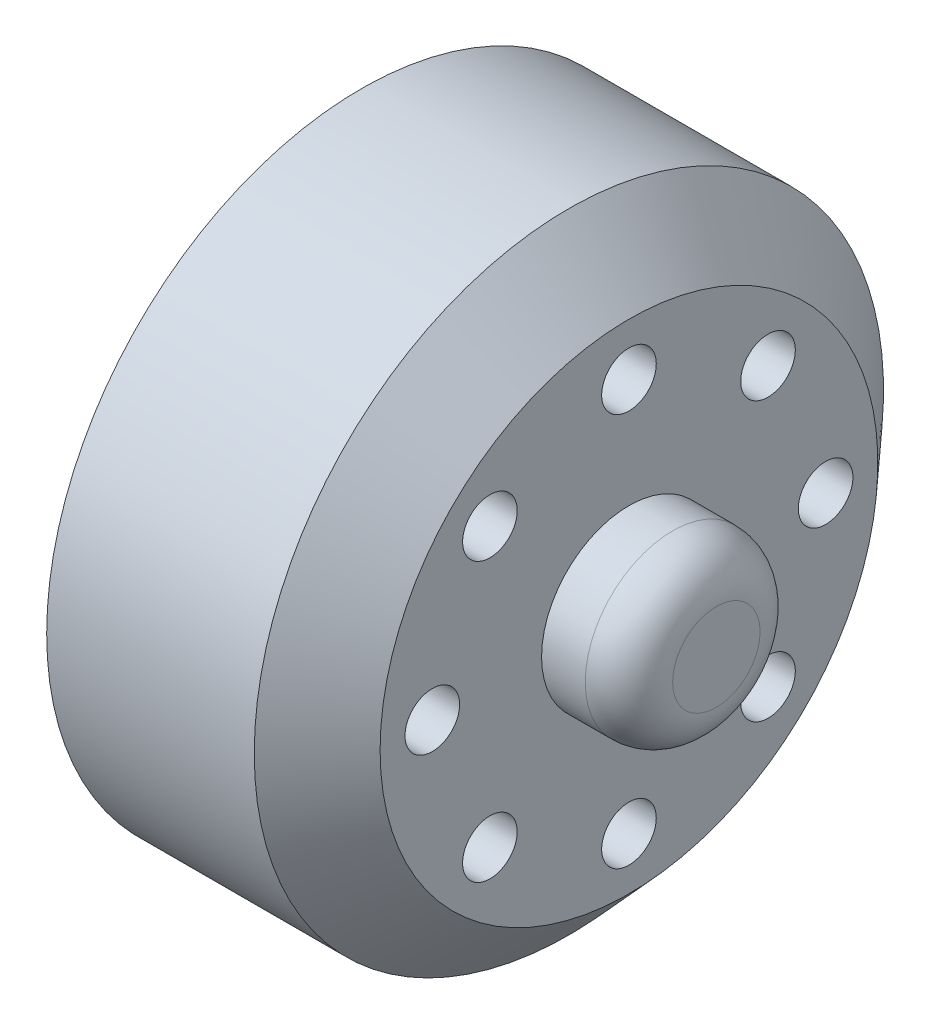
ISO-10303-21;
HEADER;
FILE_DESCRIPTION(('STEP AP214'),'2;1');
FILE_NAME('part.step','',(''),(''),'','','');
FILE_SCHEMA(('AUTOMOTIVE_DESIGN { 1 0 10303 214 1 1 1 1 }'));
ENDSEC;
DATA;
#1=APPLICATION_CONTEXT('core data for automotive mechanical design processes');
#2=APPLICATION_PROTOCOL_DEFINITION('international standard','automotive_design',2000,#1);
#3=PRODUCT_CONTEXT('',#1,'mechanical');
#4=PRODUCT('Part','Part','',(#3));
#5=PRODUCT_RELATED_PRODUCT_CATEGORY('part','',(#4));
#6=PRODUCT_DEFINITION_FORMATION('','',#4);
#7=PRODUCT_DEFINITION_CONTEXT('part definition',#1,'design');
#8=PRODUCT_DEFINITION('design','',#6,#7);
#9=PRODUCT_DEFINITION_SHAPE('','',#8);
#10=(LENGTH_UNIT() NAMED_UNIT(*) SI_UNIT(.MILLI.,.METRE.));
#11=(NAMED_UNIT(*) PLANE_ANGLE_UNIT() SI_UNIT($,.RADIAN.));
#12=(NAMED_UNIT(*) SI_UNIT($,.STERADIAN.) SOLID_ANGLE_UNIT());
#13=UNCERTAINTY_MEASURE_WITH_UNIT(LENGTH_MEASURE(1.E-05),#10,'distance_accuracy_value','');
#14=(GEOMETRIC_REPRESENTATION_CONTEXT(3) GLOBAL_UNCERTAINTY_ASSIGNED_CONTEXT((#13)) GLOBAL_UNIT_ASSIGNED_CONTEXT((#10,
#11,#12)) REPRESENTATION_CONTEXT('',''));
#15=CARTESIAN_POINT('',(0.,0.,0.));
#16=DIRECTION('',(0.,0.,1.));
#17=DIRECTION('',(1.,0.,0.));
#18=AXIS2_PLACEMENT_3D('',#15,#16,#17);
#19=CARTESIAN_POINT('',(-5.16596868854574,6.36396103067838,6.3639610306787));
#20=DIRECTION('',(1.,0.,0.));
#21=DIRECTION('',(0.,0.,-1.));
#22=AXIS2_PLACEMENT_3D('',#19,#20,#21);
#23=CYLINDRICAL_SURFACE('',#22,1.25000000000048);
#24=CARTESIAN_POINT('',(10.6195652173913,6.36396103067838,6.3639610306787));
#25=DIRECTION('',(1.,0.,0.));
#26=DIRECTION('',(0.,0.,-1.));
#27=AXIS2_PLACEMENT_3D('',#24,#25,#26);
#28=CIRCLE('',#27,1.25000000000048);
#29=CARTESIAN_POINT('',(10.6195652173913,6.36396103067838,5.11396103067823));
#30=VERTEX_POINT('',#29);
#31=EDGE_CURVE('E74',#30,#30,#28,.T.);
#32=ORIENTED_EDGE('',*,*,#31,.T.);
#33=EDGE_LOOP('',(#32));
#34=FACE_BOUND('',#33,.T.);
#35=CARTESIAN_POINT('',(5.61956521739131,6.36396103067838,6.3639610306787));
#36=DIRECTION('',(-1.,0.,0.));
#37=DIRECTION('',(0.,0.,1.));
#38=AXIS2_PLACEMENT_3D('',#35,#36,#37);
#39=CIRCLE('',#38,1.25000000000048);
#40=CARTESIAN_POINT('',(5.61956521739131,6.36396103067838,7.61396103067918));
#41=VERTEX_POINT('',#40);
#42=EDGE_CURVE('E38',#41,#41,#39,.F.);
#43=ORIENTED_EDGE('',*,*,#42,.F.);
#44=EDGE_LOOP('',(#43));
#45=FACE_BOUND('',#44,.T.);
#46=ADVANCED_FACE('F34',(#34,#45),#23,.F.);
#47=CARTESIAN_POINT('',(-5.16596868854574,-7.66835063561292E-13,8.99999999999923));
#48=DIRECTION('',(1.,0.,0.));
#49=DIRECTION('',(0.,0.,-1.));
#50=AXIS2_PLACEMENT_3D('',#47,#48,#49);
#51=CYLINDRICAL_SURFACE('',#50,1.25000000000105);
#52=CARTESIAN_POINT('',(10.6195652173913,-7.66835063561292E-13,8.99999999999923));
#53=DIRECTION('',(1.,0.,0.));
#54=DIRECTION('',(0.,0.,-1.));
#55=AXIS2_PLACEMENT_3D('',#52,#53,#54);
#56=CIRCLE('',#55,1.25000000000105);
#57=CARTESIAN_POINT('',(10.6195652173913,-7.66835063561292E-13,7.74999999999819));
#58=VERTEX_POINT('',#57);
#59=EDGE_CURVE('E78',#58,#58,#56,.T.);
#60=ORIENTED_EDGE('',*,*,#59,.T.);
#61=EDGE_LOOP('',(#60));
#62=FACE_BOUND('',#61,.T.);
#63=CARTESIAN_POINT('',(5.61956521739131,-7.66835063561292E-13,8.99999999999923));
#64=DIRECTION('',(-1.,0.,0.));
#65=DIRECTION('',(0.,0.,1.));
#66=AXIS2_PLACEMENT_3D('',#63,#64,#65);
#67=CIRCLE('',#66,1.25000000000105);
#68=CARTESIAN_POINT('',(5.61956521739131,-7.66835063561292E-13,10.2500000000003));
#69=VERTEX_POINT('',#68);
#70=EDGE_CURVE('E69',#69,#69,#67,.F.);
#71=ORIENTED_EDGE('',*,*,#70,.F.);
#72=EDGE_LOOP('',(#71));
#73=FACE_BOUND('',#72,.T.);
#74=ADVANCED_FACE('F137',(#62,#73),#51,.F.);
#75=CARTESIAN_POINT('',(-5.16596868854574,-6.36396103067947,6.36396103067762));
#76=DIRECTION('',(1.,0.,0.));
#77=DIRECTION('',(0.,0.,-1.));
#78=AXIS2_PLACEMENT_3D('',#75,#76,#77);
#79=CYLINDRICAL_SURFACE('',#78,1.25000000000148);
#80=CARTESIAN_POINT('',(10.6195652173913,-6.36396103067947,6.36396103067762));
#81=DIRECTION('',(1.,0.,0.));
#82=DIRECTION('',(0.,0.,-1.));
#83=AXIS2_PLACEMENT_3D('',#80,#81,#82);
#84=CIRCLE('',#83,1.25000000000148);
#85=CARTESIAN_POINT('',(10.6195652173913,-6.36396103067947,5.11396103067614));
#86=VERTEX_POINT('',#85);
#87=EDGE_CURVE('E83',#86,#86,#84,.T.);
#88=ORIENTED_EDGE('',*,*,#87,.T.);
#89=EDGE_LOOP('',(#88));
#90=FACE_BOUND('',#89,.T.);
#91=CARTESIAN_POINT('',(5.61956521739131,-6.36396103067947,6.36396103067762));
#92=DIRECTION('',(-1.,0.,0.));
#93=DIRECTION('',(0.,0.,1.));
#94=AXIS2_PLACEMENT_3D('',#91,#92,#93);
#95=CIRCLE('',#94,1.25000000000148);
#96=CARTESIAN_POINT('',(5.61956521739131,-6.36396103067947,7.6139610306791));
#97=VERTEX_POINT('',#96);
#98=EDGE_CURVE('E67',#97,#97,#95,.F.);
#99=ORIENTED_EDGE('',*,*,#98,.F.);
#100=EDGE_LOOP('',(#99));
#101=FACE_BOUND('',#100,.T.);
#102=ADVANCED_FACE('F142',(#90,#101),#79,.F.);
#103=CARTESIAN_POINT('',(-5.16596868854574,-9.,-1.53146576288412E-12));
#104=DIRECTION('',(1.,0.,0.));
#105=DIRECTION('',(0.,0.,-1.));
#106=AXIS2_PLACEMENT_3D('',#103,#104,#105);
#107=CYLINDRICAL_SURFACE('',#106,1.25000000000152);
#108=CARTESIAN_POINT('',(10.6195652173913,-9.,-1.53146576288412E-12));
#109=DIRECTION('',(1.,0.,0.));
#110=DIRECTION('',(0.,0.,-1.));
#111=AXIS2_PLACEMENT_3D('',#108,#109,#110);
#112=CIRCLE('',#111,1.25000000000152);
#113=CARTESIAN_POINT('',(10.6195652173913,-9.,-1.25000000000306));
#114=VERTEX_POINT('',#113);
#115=EDGE_CURVE('E222',#114,#114,#112,.T.);
#116=ORIENTED_EDGE('',*,*,#115,.T.);
#117=EDGE_LOOP('',(#116));
#118=FACE_BOUND('',#117,.T.);
#119=CARTESIAN_POINT('',(5.61956521739131,-9.,-1.53146576288412E-12));
#120=DIRECTION('',(-1.,0.,0.));
#121=DIRECTION('',(0.,0.,1.));
#122=AXIS2_PLACEMENT_3D('',#119,#120,#121);
#123=CIRCLE('',#122,1.25000000000152);
#124=CARTESIAN_POINT('',(5.61956521739131,-9.,1.24999999999999));
#125=VERTEX_POINT('',#124);
#126=EDGE_CURVE('E64',#125,#125,#123,.F.);
#127=ORIENTED_EDGE('',*,*,#126,.F.);
#128=EDGE_LOOP('',(#127));
#129=FACE_BOUND('',#128,.T.);
#130=ADVANCED_FACE('F234',(#118,#129),#107,.F.);
#131=CARTESIAN_POINT('',(-5.16596868854574,-6.36396103067839,-6.36396103068023));
#132=DIRECTION('',(1.,0.,0.));
#133=DIRECTION('',(0.,0.,-1.));
#134=AXIS2_PLACEMENT_3D('',#131,#132,#133);
#135=CYLINDRICAL_SURFACE('',#134,1.25000000000114);
#136=CARTESIAN_POINT('',(10.6195652173913,-6.36396103067839,-6.36396103068023));
#137=DIRECTION('',(1.,0.,0.));
#138=DIRECTION('',(0.,0.,-1.));
#139=AXIS2_PLACEMENT_3D('',#136,#137,#138);
#140=CIRCLE('',#139,1.25000000000114);
#141=CARTESIAN_POINT('',(10.6195652173913,-6.36396103067839,-7.61396103068137));
#142=VERTEX_POINT('',#141);
#143=EDGE_CURVE('E219',#142,#142,#140,.T.);
#144=ORIENTED_EDGE('',*,*,#143,.T.);
#145=EDGE_LOOP('',(#144));
#146=FACE_BOUND('',#145,.T.);
#147=CARTESIAN_POINT('',(5.61956521739131,-6.36396103067839,-6.36396103068023));
#148=DIRECTION('',(-1.,0.,0.));
#149=DIRECTION('',(0.,0.,1.));
#150=AXIS2_PLACEMENT_3D('',#147,#148,#149);
#151=CIRCLE('',#150,1.25000000000114);
#152=CARTESIAN_POINT('',(5.61956521739131,-6.36396103067839,-5.1139610306791));
#153=VERTEX_POINT('',#152);
#154=EDGE_CURVE('E61',#153,#153,#151,.F.);
#155=ORIENTED_EDGE('',*,*,#154,.F.);
#156=EDGE_LOOP('',(#155));
#157=FACE_BOUND('',#156,.T.);
#158=ADVANCED_FACE('F299',(#146,#157),#135,.F.);
#159=CARTESIAN_POINT('',(-5.16596868854574,7.65732881442059E-13,-9.00000000000076));
#160=DIRECTION('',(1.,0.,0.));
#161=DIRECTION('',(0.,0.,-1.));
#162=AXIS2_PLACEMENT_3D('',#159,#160,#161);
#163=CYLINDRICAL_SURFACE('',#162,1.25000000000054);
#164=CARTESIAN_POINT('',(10.6195652173913,7.65732881442059E-13,-9.00000000000076));
#165=DIRECTION('',(1.,0.,0.));
#166=DIRECTION('',(0.,0.,-1.));
#167=AXIS2_PLACEMENT_3D('',#164,#165,#166);
#168=CIRCLE('',#167,1.25000000000054);
#169=CARTESIAN_POINT('',(10.6195652173913,7.65732881442059E-13,-10.2500000000013));
#170=VERTEX_POINT('',#169);
#171=EDGE_CURVE('E216',#170,#170,#168,.T.);
#172=ORIENTED_EDGE('',*,*,#171,.T.);
#173=EDGE_LOOP('',(#172));
#174=FACE_BOUND('',#173,.T.);
#175=CARTESIAN_POINT('',(5.61956521739131,7.65732881442059E-13,-9.00000000000076));
#176=DIRECTION('',(-1.,0.,0.));
#177=DIRECTION('',(0.,0.,1.));
#178=AXIS2_PLACEMENT_3D('',#175,#176,#177);
#179=CIRCLE('',#178,1.25000000000054);
#180=CARTESIAN_POINT('',(5.61956521739131,7.65732881442059E-13,-7.75000000000023));
#181=VERTEX_POINT('',#180);
#182=EDGE_CURVE('E58',#181,#181,#179,.F.);
#183=ORIENTED_EDGE('',*,*,#182,.F.);
#184=EDGE_LOOP('',(#183));
#185=FACE_BOUND('',#184,.T.);
#186=ADVANCED_FACE('F295',(#174,#185),#163,.F.);
#187=CARTESIAN_POINT('',(-5.16596868854574,6.36396103067947,-6.36396103067915));
#188=DIRECTION('',(1.,0.,0.));
#189=DIRECTION('',(0.,0.,-1.));
#190=AXIS2_PLACEMENT_3D('',#187,#188,#189);
#191=CYLINDRICAL_SURFACE('',#190,1.25000000000007);
#192=CARTESIAN_POINT('',(10.6195652173913,6.36396103067947,-6.36396103067915));
#193=DIRECTION('',(1.,0.,0.));
#194=DIRECTION('',(0.,0.,-1.));
#195=AXIS2_PLACEMENT_3D('',#192,#193,#194);
#196=CIRCLE('',#195,1.25000000000007);
#197=CARTESIAN_POINT('',(10.6195652173913,6.36396103067947,-7.61396103067922));
#198=VERTEX_POINT('',#197);
#199=EDGE_CURVE('E213',#198,#198,#196,.T.);
#200=ORIENTED_EDGE('',*,*,#199,.T.);
#201=EDGE_LOOP('',(#200));
#202=FACE_BOUND('',#201,.T.);
#203=CARTESIAN_POINT('',(5.61956521739131,6.36396103067947,-6.36396103067915));
#204=DIRECTION('',(-1.,0.,0.));
#205=DIRECTION('',(0.,0.,1.));
#206=AXIS2_PLACEMENT_3D('',#203,#204,#205);
#207=CIRCLE('',#206,1.25000000000007);
#208=CARTESIAN_POINT('',(5.61956521739131,6.36396103067947,-5.11396103067908));
#209=VERTEX_POINT('',#208);
#210=EDGE_CURVE('E54',#209,#209,#207,.F.);
#211=ORIENTED_EDGE('',*,*,#210,.F.);
#212=EDGE_LOOP('',(#211));
#213=FACE_BOUND('',#212,.T.);
#214=ADVANCED_FACE('F166',(#202,#213),#191,.F.);
#215=CARTESIAN_POINT('',(-5.16596868854574,9.,0.));
#216=DIRECTION('',(1.,0.,0.));
#217=DIRECTION('',(0.,0.,-1.));
#218=AXIS2_PLACEMENT_3D('',#215,#216,#217);
#219=CYLINDRICAL_SURFACE('',#218,1.25);
#220=CARTESIAN_POINT('',(10.6195652173913,9.,0.));
#221=DIRECTION('',(1.,0.,0.));
#222=DIRECTION('',(0.,0.,-1.));
#223=AXIS2_PLACEMENT_3D('',#220,#221,#222);
#224=CIRCLE('',#223,1.25);
#225=CARTESIAN_POINT('',(10.6195652173913,9.,-1.25));
#226=VERTEX_POINT('',#225);
#227=EDGE_CURVE('E91',#226,#226,#224,.T.);
#228=ORIENTED_EDGE('',*,*,#227,.T.);
#229=EDGE_LOOP('',(#228));
#230=FACE_BOUND('',#229,.T.);
#231=CARTESIAN_POINT('',(5.61956521739131,9.,0.));
#232=DIRECTION('',(-1.,0.,0.));
#233=DIRECTION('',(0.,0.,1.));
#234=AXIS2_PLACEMENT_3D('',#231,#232,#233);
#235=CIRCLE('',#234,1.25);
#236=CARTESIAN_POINT('',(5.61956521739131,9.,1.25));
#237=VERTEX_POINT('',#236);
#238=EDGE_CURVE('E51',#237,#237,#235,.F.);
#239=ORIENTED_EDGE('',*,*,#238,.F.);
#240=EDGE_LOOP('',(#239));
#241=FACE_BOUND('',#240,.T.);
#242=ADVANCED_FACE('F161',(#230,#241),#219,.F.);
#243=CARTESIAN_POINT('',(-1.63043478260869,0.,-14.4));
#244=DIRECTION('',(1.,0.,0.));
#245=DIRECTION('',(0.,0.,-1.));
#246=AXIS2_PLACEMENT_3D('',#243,#244,#245);
#247=PLANE('',#246);
#248=CARTESIAN_POINT('',(-1.63043478260869,6.36396103067838,-6.3639610306787));
#249=DIRECTION('',(-1.,0.,0.));
#250=DIRECTION('',(0.,0.,1.));
#251=AXIS2_PLACEMENT_3D('',#248,#249,#250);
#252=CIRCLE('',#251,2.50000000000048);
#253=CARTESIAN_POINT('',(-1.63043478260869,6.36396103067838,-3.86396103067823));
#254=VERTEX_POINT('',#253);
#255=EDGE_CURVE('E172',#254,#254,#252,.T.);
#256=ORIENTED_EDGE('',*,*,#255,.F.);
#257=EDGE_LOOP('',(#256));
#258=FACE_BOUND('',#257,.T.);
#259=CARTESIAN_POINT('',(-1.63043478260869,-7.66835063561292E-13,-8.99999999999923));
#260=DIRECTION('',(-1.,0.,0.));
#261=DIRECTION('',(0.,0.,1.));
#262=AXIS2_PLACEMENT_3D('',#259,#260,#261);
#263=CIRCLE('',#262,2.50000000000105);
#264=CARTESIAN_POINT('',(-1.63043478260869,-7.66835063561292E-13,-6.49999999999819));
#265=VERTEX_POINT('',#264);
#266=EDGE_CURVE('E176',#265,#265,#263,.T.);
#267=ORIENTED_EDGE('',*,*,#266,.F.);
#268=EDGE_LOOP('',(#267));
#269=FACE_BOUND('',#268,.T.);
#270=CARTESIAN_POINT('',(-1.63043478260869,-6.36396103067947,-6.36396103067762));
#271=DIRECTION('',(-1.,0.,0.));
#272=DIRECTION('',(0.,0.,1.));
#273=AXIS2_PLACEMENT_3D('',#270,#271,#272);
#274=CIRCLE('',#273,2.50000000000148);
#275=CARTESIAN_POINT('',(-1.63043478260869,-6.36396103067947,-3.86396103067614));
#276=VERTEX_POINT('',#275);
#277=EDGE_CURVE('E180',#276,#276,#274,.T.);
#278=ORIENTED_EDGE('',*,*,#277,.F.);
#279=EDGE_LOOP('',(#278));
#280=FACE_BOUND('',#279,.T.);
#281=CARTESIAN_POINT('',(-1.63043478260869,-9.,1.53146576288412E-12));
#282=DIRECTION('',(-1.,0.,0.));
#283=DIRECTION('',(0.,0.,1.));
#284=AXIS2_PLACEMENT_3D('',#281,#282,#283);
#285=CIRCLE('',#284,2.50000000000153);
#286=CARTESIAN_POINT('',(-1.63043478260869,-9.,2.50000000000306));
#287=VERTEX_POINT('',#286);
#288=EDGE_CURVE('E184',#287,#287,#285,.T.);
#289=ORIENTED_EDGE('',*,*,#288,.F.);
#290=EDGE_LOOP('',(#289));
#291=FACE_BOUND('',#290,.T.);
#292=CARTESIAN_POINT('',(-1.63043478260869,-6.36396103067839,6.36396103068023));
#293=DIRECTION('',(-1.,0.,0.));
#294=DIRECTION('',(0.,0.,1.));
#295=AXIS2_PLACEMENT_3D('',#292,#293,#294);
#296=CIRCLE('',#295,2.50000000000114);
#297=CARTESIAN_POINT('',(-1.63043478260869,-6.36396103067839,8.86396103068137));
#298=VERTEX_POINT('',#297);
#299=EDGE_CURVE('E188',#298,#298,#296,.T.);
#300=ORIENTED_EDGE('',*,*,#299,.F.);
#301=EDGE_LOOP('',(#300));
#302=FACE_BOUND('',#301,.T.);
#303=CARTESIAN_POINT('',(-1.63043478260869,7.65732881442059E-13,9.00000000000076));
#304=DIRECTION('',(-1.,0.,0.));
#305=DIRECTION('',(0.,0.,1.));
#306=AXIS2_PLACEMENT_3D('',#303,#304,#305);
#307=CIRCLE('',#306,2.50000000000054);
#308=CARTESIAN_POINT('',(-1.63043478260869,7.65732881442059E-13,11.5000000000013));
#309=VERTEX_POINT('',#308);
#310=EDGE_CURVE('E192',#309,#309,#307,.T.);
#311=ORIENTED_EDGE('',*,*,#310,.F.);
#312=EDGE_LOOP('',(#311));
#313=FACE_BOUND('',#312,.T.);
#314=CARTESIAN_POINT('',(-1.63043478260869,6.36396103067947,6.36396103067915));
#315=DIRECTION('',(-1.,0.,0.));
#316=DIRECTION('',(0.,0.,1.));
#317=AXIS2_PLACEMENT_3D('',#314,#315,#316);
#318=CIRCLE('',#317,2.50000000000007);
#319=CARTESIAN_POINT('',(-1.63043478260869,6.36396103067947,8.86396103067922));
#320=VERTEX_POINT('',#319);
#321=EDGE_CURVE('E196',#320,#320,#318,.T.);
#322=ORIENTED_EDGE('',*,*,#321,.F.);
#323=EDGE_LOOP('',(#322));
#324=FACE_BOUND('',#323,.T.);
#325=CARTESIAN_POINT('',(-1.63043478260869,9.,0.));
#326=DIRECTION('',(-1.,0.,0.));
#327=DIRECTION('',(0.,0.,1.));
#328=AXIS2_PLACEMENT_3D('',#325,#326,#327);
#329=CIRCLE('',#328,2.5);
#330=CARTESIAN_POINT('',(-1.63043478260869,9.,2.5));
#331=VERTEX_POINT('',#330);
#332=EDGE_CURVE('E199',#331,#331,#329,.T.);
#333=ORIENTED_EDGE('',*,*,#332,.F.);
#334=EDGE_LOOP('',(#333));
#335=FACE_BOUND('',#334,.T.);
#336=CARTESIAN_POINT('',(-1.63043478260869,0.,0.));
#337=DIRECTION('',(-1.,0.,0.));
#338=DIRECTION('',(0.,0.,1.));
#339=AXIS2_PLACEMENT_3D('',#336,#337,#338);
#340=CIRCLE('',#339,5.7);
#341=CARTESIAN_POINT('',(-1.63043478260869,0.,5.7));
#342=VERTEX_POINT('',#341);
#343=EDGE_CURVE('E87',#342,#342,#340,.T.);
#344=ORIENTED_EDGE('',*,*,#343,.F.);
#345=EDGE_LOOP('',(#344));
#346=FACE_BOUND('',#345,.T.);
#347=CARTESIAN_POINT('',(-1.63043478260869,0.,0.));
#348=DIRECTION('',(-1.,0.,0.));
#349=DIRECTION('',(0.,0.,1.));
#350=AXIS2_PLACEMENT_3D('',#347,#348,#349);
#351=CIRCLE('',#350,14.4);
#352=CARTESIAN_POINT('',(-1.63043478260869,0.,14.4));
#353=VERTEX_POINT('',#352);
#354=EDGE_CURVE('E47',#353,#353,#351,.T.);
#355=ORIENTED_EDGE('',*,*,#354,.T.);
#356=EDGE_LOOP('',(#355));
#357=FACE_BOUND('',#356,.T.);
#358=ADVANCED_FACE('F105',(#258,#269,#280,#291,#302,#313,#324,#335,#346,#357),#247,.F.);
#359=CARTESIAN_POINT('',(-12.3913043478261,0.,0.));
#360=DIRECTION('',(-1.,0.,0.));
#361=DIRECTION('',(0.,0.,1.));
#362=AXIS2_PLACEMENT_3D('',#359,#360,#361);
#363=CYLINDRICAL_SURFACE('',#362,14.4);
#364=ORIENTED_EDGE('',*,*,#354,.F.);
#365=EDGE_LOOP('',(#364));
#366=FACE_BOUND('',#365,.T.);
#367=CARTESIAN_POINT('',(7.8695652173913,0.,0.));
#368=DIRECTION('',(-1.,0.,0.));
#369=DIRECTION('',(0.,0.,1.));
#370=AXIS2_PLACEMENT_3D('',#367,#368,#369);
#371=CIRCLE('',#370,14.4);
#372=CARTESIAN_POINT('',(7.8695652173913,0.,14.4));
#373=VERTEX_POINT('',#372);
#374=EDGE_CURVE('E100',#373,#373,#371,.T.);
#375=ORIENTED_EDGE('',*,*,#374,.T.);
#376=EDGE_LOOP('',(#375));
#377=FACE_BOUND('',#376,.T.);
#378=ADVANCED_FACE('F107',(#366,#377),#363,.T.);
#379=CARTESIAN_POINT('',(10.6195652173913,0.,0.));
#380=DIRECTION('',(-1.,0.,0.));
#381=DIRECTION('',(0.,0.,1.));
#382=AXIS2_PLACEMENT_3D('',#379,#380,#381);
#383=CONICAL_SURFACE('',#382,11.3904761178154,0.830427658098904);
#384=ORIENTED_EDGE('',*,*,#374,.F.);
#385=EDGE_LOOP('',(#384));
#386=FACE_BOUND('',#385,.T.);
#387=CARTESIAN_POINT('',(10.6195652173913,0.,0.));
#388=DIRECTION('',(-1.,0.,0.));
#389=DIRECTION('',(0.,0.,1.));
#390=AXIS2_PLACEMENT_3D('',#387,#388,#389);
#391=CIRCLE('',#390,11.3904761178154);
#392=CARTESIAN_POINT('',(10.6195652173913,0.,11.3904761178154));
#393=VERTEX_POINT('',#392);
#394=EDGE_CURVE('E97',#393,#393,#391,.T.);
#395=ORIENTED_EDGE('',*,*,#394,.T.);
#396=EDGE_LOOP('',(#395));
#397=FACE_BOUND('',#396,.T.);
#398=ADVANCED_FACE('F110',(#386,#397),#383,.T.);
#399=CARTESIAN_POINT('',(10.6195652173913,0.,-11.3904761178154));
#400=DIRECTION('',(-1.,0.,0.));
#401=DIRECTION('',(0.,0.,1.));
#402=AXIS2_PLACEMENT_3D('',#399,#400,#401);
#403=PLANE('',#402);
#404=ORIENTED_EDGE('',*,*,#227,.F.);
#405=EDGE_LOOP('',(#404));
#406=FACE_BOUND('',#405,.T.);
#407=ORIENTED_EDGE('',*,*,#199,.F.);
#408=EDGE_LOOP('',(#407));
#409=FACE_BOUND('',#408,.T.);
#410=ORIENTED_EDGE('',*,*,#171,.F.);
#411=EDGE_LOOP('',(#410));
#412=FACE_BOUND('',#411,.T.);
#413=ORIENTED_EDGE('',*,*,#143,.F.);
#414=EDGE_LOOP('',(#413));
#415=FACE_BOUND('',#414,.T.);
#416=ORIENTED_EDGE('',*,*,#115,.F.);
#417=EDGE_LOOP('',(#416));
#418=FACE_BOUND('',#417,.T.);
#419=ORIENTED_EDGE('',*,*,#87,.F.);
#420=EDGE_LOOP('',(#419));
#421=FACE_BOUND('',#420,.T.);
#422=ORIENTED_EDGE('',*,*,#59,.F.);
#423=EDGE_LOOP('',(#422));
#424=FACE_BOUND('',#423,.T.);
#425=ORIENTED_EDGE('',*,*,#31,.F.);
#426=EDGE_LOOP('',(#425));
#427=FACE_BOUND('',#426,.T.);
#428=ORIENTED_EDGE('',*,*,#394,.F.);
#429=EDGE_LOOP('',(#428));
#430=FACE_BOUND('',#429,.T.);
#431=CARTESIAN_POINT('',(10.6195652173913,0.,0.));
#432=DIRECTION('',(-1.,0.,0.));
#433=DIRECTION('',(0.,0.,1.));
#434=AXIS2_PLACEMENT_3D('',#431,#432,#433);
#435=CIRCLE('',#434,4.);
#436=CARTESIAN_POINT('',(10.6195652173913,0.,4.));
#437=VERTEX_POINT('',#436);
#438=EDGE_CURVE('E94',#437,#437,#435,.T.);
#439=ORIENTED_EDGE('',*,*,#438,.T.);
#440=EDGE_LOOP('',(#439));
#441=FACE_BOUND('',#440,.T.);
#442=ADVANCED_FACE('F116',(#406,#409,#412,#415,#418,#421,#424,#427,#430,#441),#403,.F.);
#443=CARTESIAN_POINT('',(-12.3913043478261,0.,0.));
#444=DIRECTION('',(-1.,0.,0.));
#445=DIRECTION('',(0.,0.,1.));
#446=AXIS2_PLACEMENT_3D('',#443,#444,#445);
#447=CYLINDRICAL_SURFACE('',#446,4.);
#448=CARTESIAN_POINT('',(12.6195652173913,0.,0.));
#449=DIRECTION('',(-1.,0.,0.));
#450=DIRECTION('',(0.,0.,1.));
#451=AXIS2_PLACEMENT_3D('',#448,#449,#450);
#452=CIRCLE('',#451,4.);
#453=CARTESIAN_POINT('',(12.6195652173913,0.,4.));
#454=VERTEX_POINT('',#453);
#455=EDGE_CURVE('E42',#454,#454,#452,.T.);
#456=ORIENTED_EDGE('',*,*,#455,.T.);
#457=EDGE_LOOP('',(#456));
#458=FACE_BOUND('',#457,.T.);
#459=ORIENTED_EDGE('',*,*,#438,.F.);
#460=EDGE_LOOP('',(#459));
#461=FACE_BOUND('',#460,.T.);
#462=ADVANCED_FACE('F122',(#458,#461),#447,.T.);
#463=CARTESIAN_POINT('',(14.6195652173913,0.,-4.));
#464=DIRECTION('',(-1.,0.,0.));
#465=DIRECTION('',(0.,0.,1.));
#466=AXIS2_PLACEMENT_3D('',#463,#464,#465);
#467=PLANE('',#466);
#468=CARTESIAN_POINT('',(14.6195652173913,0.,0.));
#469=DIRECTION('',(-1.,0.,0.));
#470=DIRECTION('',(0.,0.,1.));
#471=AXIS2_PLACEMENT_3D('',#468,#469,#470);
#472=CIRCLE('',#471,2.);
#473=CARTESIAN_POINT('',(14.6195652173913,0.,2.));
#474=VERTEX_POINT('',#473);
#475=EDGE_CURVE('E11',#474,#474,#472,.F.);
#476=ORIENTED_EDGE('',*,*,#475,.T.);
#477=EDGE_LOOP('',(#476));
#478=FACE_BOUND('',#477,.T.);
#479=ADVANCED_FACE('F128',(#478),#467,.F.);
#480=CARTESIAN_POINT('',(3.07169239559481,0.,-5.7));
#481=DIRECTION('',(1.,0.,0.));
#482=DIRECTION('',(0.,0.,-1.));
#483=AXIS2_PLACEMENT_3D('',#480,#481,#482);
#484=PLANE('',#483);
#485=CARTESIAN_POINT('',(3.07169239559481,0.,0.));
#486=DIRECTION('',(-1.,0.,0.));
#487=DIRECTION('',(0.,0.,1.));
#488=AXIS2_PLACEMENT_3D('',#485,#486,#487);
#489=CIRCLE('',#488,5.7);
#490=CARTESIAN_POINT('',(3.07169239559481,0.,5.7));
#491=VERTEX_POINT('',#490);
#492=EDGE_CURVE('E90',#491,#491,#489,.T.);
#493=ORIENTED_EDGE('',*,*,#492,.T.);
#494=EDGE_LOOP('',(#493));
#495=FACE_BOUND('',#494,.T.);
#496=ADVANCED_FACE('F134',(#495),#484,.F.);
#497=CARTESIAN_POINT('',(-12.3913043478261,0.,0.));
#498=DIRECTION('',(-1.,0.,0.));
#499=DIRECTION('',(0.,0.,1.));
#500=AXIS2_PLACEMENT_3D('',#497,#498,#499);
#501=CYLINDRICAL_SURFACE('',#500,5.7);
#502=ORIENTED_EDGE('',*,*,#492,.F.);
#503=EDGE_LOOP('',(#502));
#504=FACE_BOUND('',#503,.T.);
#505=ORIENTED_EDGE('',*,*,#343,.T.);
#506=EDGE_LOOP('',(#505));
#507=FACE_BOUND('',#506,.T.);
#508=ADVANCED_FACE('F148',(#504,#507),#501,.F.);
#509=CARTESIAN_POINT('',(12.6195652173913,0.,0.));
#510=DIRECTION('',(-1.,0.,0.));
#511=DIRECTION('',(0.,0.,1.));
#512=AXIS2_PLACEMENT_3D('',#509,#510,#511);
#513=DEGENERATE_TOROIDAL_SURFACE('',#512,2.,2.,.T.);
#514=ORIENTED_EDGE('',*,*,#475,.F.);
#515=EDGE_LOOP('',(#514));
#516=FACE_BOUND('',#515,.T.);
#517=ORIENTED_EDGE('',*,*,#455,.F.);
#518=EDGE_LOOP('',(#517));
#519=FACE_BOUND('',#518,.T.);
#520=ADVANCED_FACE('F36',(#516,#519),#513,.T.);
#521=CARTESIAN_POINT('',(5.61956521739131,0.,-11.3904761178154));
#522=DIRECTION('',(-1.,0.,0.));
#523=DIRECTION('',(0.,0.,1.));
#524=AXIS2_PLACEMENT_3D('',#521,#522,#523);
#525=PLANE('',#524);
#526=CARTESIAN_POINT('',(5.61956521739131,9.,0.));
#527=DIRECTION('',(-1.,0.,0.));
#528=DIRECTION('',(0.,0.,1.));
#529=AXIS2_PLACEMENT_3D('',#526,#527,#528);
#530=CIRCLE('',#529,2.5);
#531=CARTESIAN_POINT('',(5.61956521739131,9.,2.5));
#532=VERTEX_POINT('',#531);
#533=EDGE_CURVE('E55',#532,#532,#530,.F.);
#534=ORIENTED_EDGE('',*,*,#533,.F.);
#535=EDGE_LOOP('',(#534));
#536=FACE_BOUND('',#535,.T.);
#537=ORIENTED_EDGE('',*,*,#238,.T.);
#538=EDGE_LOOP('',(#537));
#539=FACE_BOUND('',#538,.T.);
#540=ADVANCED_FACE('F286',(#536,#539),#525,.T.);
#541=CARTESIAN_POINT('',(17.6906330292611,9.,0.));
#542=DIRECTION('',(-1.,0.,0.));
#543=DIRECTION('',(0.,0.,1.));
#544=AXIS2_PLACEMENT_3D('',#541,#542,#543);
#545=CYLINDRICAL_SURFACE('',#544,2.5);
#546=ORIENTED_EDGE('',*,*,#533,.T.);
#547=EDGE_LOOP('',(#546));
#548=FACE_BOUND('',#547,.T.);
#549=ORIENTED_EDGE('',*,*,#332,.T.);
#550=EDGE_LOOP('',(#549));
#551=FACE_BOUND('',#550,.T.);
#552=ADVANCED_FACE('F281',(#548,#551),#545,.F.);
#553=CARTESIAN_POINT('',(5.61956521739131,0.,-11.3904761178154));
#554=DIRECTION('',(-1.,0.,0.));
#555=DIRECTION('',(0.,0.,1.));
#556=AXIS2_PLACEMENT_3D('',#553,#554,#555);
#557=PLANE('',#556);
#558=CARTESIAN_POINT('',(5.61956521739131,6.36396103067838,-6.3639610306787));
#559=DIRECTION('',(-1.,0.,0.));
#560=DIRECTION('',(0.,0.,1.));
#561=AXIS2_PLACEMENT_3D('',#558,#559,#560);
#562=CIRCLE('',#561,2.50000000000048);
#563=CARTESIAN_POINT('',(5.61956521739131,6.36396103067838,-3.86396103067823));
#564=VERTEX_POINT('',#563);
#565=EDGE_CURVE('E208',#564,#564,#562,.F.);
#566=ORIENTED_EDGE('',*,*,#565,.F.);
#567=EDGE_LOOP('',(#566));
#568=FACE_BOUND('',#567,.T.);
#569=ORIENTED_EDGE('',*,*,#210,.T.);
#570=EDGE_LOOP('',(#569));
#571=FACE_BOUND('',#570,.T.);
#572=ADVANCED_FACE('F278',(#568,#571),#557,.T.);
#573=CARTESIAN_POINT('',(17.6906330292611,6.36396103067838,-6.3639610306787));
#574=DIRECTION('',(-1.,0.,0.));
#575=DIRECTION('',(0.,0.,1.));
#576=AXIS2_PLACEMENT_3D('',#573,#574,#575);
#577=CYLINDRICAL_SURFACE('',#576,2.50000000000048);
#578=ORIENTED_EDGE('',*,*,#565,.T.);
#579=EDGE_LOOP('',(#578));
#580=FACE_BOUND('',#579,.T.);
#581=ORIENTED_EDGE('',*,*,#255,.T.);
#582=EDGE_LOOP('',(#581));
#583=FACE_BOUND('',#582,.T.);
#584=ADVANCED_FACE('F273',(#580,#583),#577,.F.);
#585=CARTESIAN_POINT('',(5.61956521739131,0.,-11.3904761178154));
#586=DIRECTION('',(-1.,0.,0.));
#587=DIRECTION('',(0.,0.,1.));
#588=AXIS2_PLACEMENT_3D('',#585,#586,#587);
#589=PLANE('',#588);
#590=CARTESIAN_POINT('',(5.61956521739131,-7.66835063561292E-13,-8.99999999999923));
#591=DIRECTION('',(-1.,0.,0.));
#592=DIRECTION('',(0.,0.,1.));
#593=AXIS2_PLACEMENT_3D('',#590,#591,#592);
#594=CIRCLE('',#593,2.50000000000105);
#595=CARTESIAN_POINT('',(5.61956521739131,-7.66835063561292E-13,-6.49999999999819));
#596=VERTEX_POINT('',#595);
#597=EDGE_CURVE('E467',#596,#596,#594,.F.);
#598=ORIENTED_EDGE('',*,*,#597,.F.);
#599=EDGE_LOOP('',(#598));
#600=FACE_BOUND('',#599,.T.);
#601=ORIENTED_EDGE('',*,*,#182,.T.);
#602=EDGE_LOOP('',(#601));
#603=FACE_BOUND('',#602,.T.);
#604=ADVANCED_FACE('F270',(#600,#603),#589,.T.);
#605=CARTESIAN_POINT('',(17.6906330292611,-7.66835063561292E-13,-8.99999999999923));
#606=DIRECTION('',(-1.,0.,0.));
#607=DIRECTION('',(0.,0.,1.));
#608=AXIS2_PLACEMENT_3D('',#605,#606,#607);
#609=CYLINDRICAL_SURFACE('',#608,2.50000000000105);
#610=ORIENTED_EDGE('',*,*,#597,.T.);
#611=EDGE_LOOP('',(#610));
#612=FACE_BOUND('',#611,.T.);
#613=ORIENTED_EDGE('',*,*,#266,.T.);
#614=EDGE_LOOP('',(#613));
#615=FACE_BOUND('',#614,.T.);
#616=ADVANCED_FACE('F265',(#612,#615),#609,.F.);
#617=CARTESIAN_POINT('',(5.61956521739131,0.,-11.3904761178154));
#618=DIRECTION('',(-1.,0.,0.));
#619=DIRECTION('',(0.,0.,1.));
#620=AXIS2_PLACEMENT_3D('',#617,#618,#619);
#621=PLANE('',#620);
#622=CARTESIAN_POINT('',(5.61956521739131,-6.36396103067947,-6.36396103067762));
#623=DIRECTION('',(-1.,0.,0.));
#624=DIRECTION('',(0.,0.,1.));
#625=AXIS2_PLACEMENT_3D('',#622,#623,#624);
#626=CIRCLE('',#625,2.50000000000148);
#627=CARTESIAN_POINT('',(5.61956521739131,-6.36396103067947,-3.86396103067614));
#628=VERTEX_POINT('',#627);
#629=EDGE_CURVE('E463',#628,#628,#626,.F.);
#630=ORIENTED_EDGE('',*,*,#629,.F.);
#631=EDGE_LOOP('',(#630));
#632=FACE_BOUND('',#631,.T.);
#633=ORIENTED_EDGE('',*,*,#154,.T.);
#634=EDGE_LOOP('',(#633));
#635=FACE_BOUND('',#634,.T.);
#636=ADVANCED_FACE('F262',(#632,#635),#621,.T.);
#637=CARTESIAN_POINT('',(17.6906330292611,-6.36396103067947,-6.36396103067762));
#638=DIRECTION('',(-1.,0.,0.));
#639=DIRECTION('',(0.,0.,1.));
#640=AXIS2_PLACEMENT_3D('',#637,#638,#639);
#641=CYLINDRICAL_SURFACE('',#640,2.50000000000148);
#642=ORIENTED_EDGE('',*,*,#629,.T.);
#643=EDGE_LOOP('',(#642));
#644=FACE_BOUND('',#643,.T.);
#645=ORIENTED_EDGE('',*,*,#277,.T.);
#646=EDGE_LOOP('',(#645));
#647=FACE_BOUND('',#646,.T.);
#648=ADVANCED_FACE('F259',(#644,#647),#641,.F.);
#649=CARTESIAN_POINT('',(5.61956521739131,0.,-11.3904761178154));
#650=DIRECTION('',(-1.,0.,0.));
#651=DIRECTION('',(0.,0.,1.));
#652=AXIS2_PLACEMENT_3D('',#649,#650,#651);
#653=PLANE('',#652);
#654=CARTESIAN_POINT('',(5.61956521739131,-9.,1.53146576288412E-12));
#655=DIRECTION('',(-1.,0.,0.));
#656=DIRECTION('',(0.,0.,1.));
#657=AXIS2_PLACEMENT_3D('',#654,#655,#656);
#658=CIRCLE('',#657,2.50000000000153);
#659=CARTESIAN_POINT('',(5.61956521739131,-9.,2.50000000000306));
#660=VERTEX_POINT('',#659);
#661=EDGE_CURVE('E459',#660,#660,#658,.F.);
#662=ORIENTED_EDGE('',*,*,#661,.F.);
#663=EDGE_LOOP('',(#662));
#664=FACE_BOUND('',#663,.T.);
#665=ORIENTED_EDGE('',*,*,#126,.T.);
#666=EDGE_LOOP('',(#665));
#667=FACE_BOUND('',#666,.T.);
#668=ADVANCED_FACE('F250',(#664,#667),#653,.T.);
#669=CARTESIAN_POINT('',(17.6906330292611,-9.,1.53146576288412E-12));
#670=DIRECTION('',(-1.,0.,0.));
#671=DIRECTION('',(0.,0.,1.));
#672=AXIS2_PLACEMENT_3D('',#669,#670,#671);
#673=CYLINDRICAL_SURFACE('',#672,2.50000000000153);
#674=ORIENTED_EDGE('',*,*,#661,.T.);
#675=EDGE_LOOP('',(#674));
#676=FACE_BOUND('',#675,.T.);
#677=ORIENTED_EDGE('',*,*,#288,.T.);
#678=EDGE_LOOP('',(#677));
#679=FACE_BOUND('',#678,.T.);
#680=ADVANCED_FACE('F240',(#676,#679),#673,.F.);
#681=CARTESIAN_POINT('',(5.61956521739131,0.,-11.3904761178154));
#682=DIRECTION('',(-1.,0.,0.));
#683=DIRECTION('',(0.,0.,1.));
#684=AXIS2_PLACEMENT_3D('',#681,#682,#683);
#685=PLANE('',#684);
#686=CARTESIAN_POINT('',(5.61956521739131,-6.36396103067839,6.36396103068023));
#687=DIRECTION('',(-1.,0.,0.));
#688=DIRECTION('',(0.,0.,1.));
#689=AXIS2_PLACEMENT_3D('',#686,#687,#688);
#690=CIRCLE('',#689,2.50000000000114);
#691=CARTESIAN_POINT('',(5.61956521739131,-6.36396103067839,8.86396103068137));
#692=VERTEX_POINT('',#691);
#693=EDGE_CURVE('E456',#692,#692,#690,.F.);
#694=ORIENTED_EDGE('',*,*,#693,.F.);
#695=EDGE_LOOP('',(#694));
#696=FACE_BOUND('',#695,.T.);
#697=ORIENTED_EDGE('',*,*,#98,.T.);
#698=EDGE_LOOP('',(#697));
#699=FACE_BOUND('',#698,.T.);
#700=ADVANCED_FACE('F237',(#696,#699),#685,.T.);
#701=CARTESIAN_POINT('',(17.6906330292611,-6.36396103067839,6.36396103068023));
#702=DIRECTION('',(-1.,0.,0.));
#703=DIRECTION('',(0.,0.,1.));
#704=AXIS2_PLACEMENT_3D('',#701,#702,#703);
#705=CYLINDRICAL_SURFACE('',#704,2.50000000000114);
#706=ORIENTED_EDGE('',*,*,#693,.T.);
#707=EDGE_LOOP('',(#706));
#708=FACE_BOUND('',#707,.T.);
#709=ORIENTED_EDGE('',*,*,#299,.T.);
#710=EDGE_LOOP('',(#709));
#711=FACE_BOUND('',#710,.T.);
#712=ADVANCED_FACE('F239',(#708,#711),#705,.F.);
#713=CARTESIAN_POINT('',(5.61956521739131,0.,-11.3904761178154));
#714=DIRECTION('',(-1.,0.,0.));
#715=DIRECTION('',(0.,0.,1.));
#716=AXIS2_PLACEMENT_3D('',#713,#714,#715);
#717=PLANE('',#716);
#718=CARTESIAN_POINT('',(5.61956521739131,7.65732881442059E-13,9.00000000000076));
#719=DIRECTION('',(-1.,0.,0.));
#720=DIRECTION('',(0.,0.,1.));
#721=AXIS2_PLACEMENT_3D('',#718,#719,#720);
#722=CIRCLE('',#721,2.50000000000054);
#723=CARTESIAN_POINT('',(5.61956521739131,7.65732881442059E-13,11.5000000000013));
#724=VERTEX_POINT('',#723);
#725=EDGE_CURVE('E451',#724,#724,#722,.F.);
#726=ORIENTED_EDGE('',*,*,#725,.F.);
#727=EDGE_LOOP('',(#726));
#728=FACE_BOUND('',#727,.T.);
#729=ORIENTED_EDGE('',*,*,#70,.T.);
#730=EDGE_LOOP('',(#729));
#731=FACE_BOUND('',#730,.T.);
#732=ADVANCED_FACE('F247',(#728,#731),#717,.T.);
#733=CARTESIAN_POINT('',(17.6906330292611,7.65732881442059E-13,9.00000000000076));
#734=DIRECTION('',(-1.,0.,0.));
#735=DIRECTION('',(0.,0.,1.));
#736=AXIS2_PLACEMENT_3D('',#733,#734,#735);
#737=CYLINDRICAL_SURFACE('',#736,2.50000000000054);
#738=ORIENTED_EDGE('',*,*,#725,.T.);
#739=EDGE_LOOP('',(#738));
#740=FACE_BOUND('',#739,.T.);
#741=ORIENTED_EDGE('',*,*,#310,.T.);
#742=EDGE_LOOP('',(#741));
#743=FACE_BOUND('',#742,.T.);
#744=ADVANCED_FACE('F255',(#740,#743),#737,.F.);
#745=CARTESIAN_POINT('',(5.61956521739131,0.,-11.3904761178154));
#746=DIRECTION('',(-1.,0.,0.));
#747=DIRECTION('',(0.,0.,1.));
#748=AXIS2_PLACEMENT_3D('',#745,#746,#747);
#749=PLANE('',#748);
#750=CARTESIAN_POINT('',(5.61956521739131,6.36396103067947,6.36396103067915));
#751=DIRECTION('',(-1.,0.,0.));
#752=DIRECTION('',(0.,0.,1.));
#753=AXIS2_PLACEMENT_3D('',#750,#751,#752);
#754=CIRCLE('',#753,2.50000000000007);
#755=CARTESIAN_POINT('',(5.61956521739131,6.36396103067947,8.86396103067922));
#756=VERTEX_POINT('',#755);
#757=EDGE_CURVE('E201',#756,#756,#754,.F.);
#758=ORIENTED_EDGE('',*,*,#757,.F.);
#759=EDGE_LOOP('',(#758));
#760=FACE_BOUND('',#759,.T.);
#761=ORIENTED_EDGE('',*,*,#42,.T.);
#762=EDGE_LOOP('',(#761));
#763=FACE_BOUND('',#762,.T.);
#764=ADVANCED_FACE('F426',(#760,#763),#749,.T.);
#765=CARTESIAN_POINT('',(17.6906330292611,6.36396103067947,6.36396103067915));
#766=DIRECTION('',(-1.,0.,0.));
#767=DIRECTION('',(0.,0.,1.));
#768=AXIS2_PLACEMENT_3D('',#765,#766,#767);
#769=CYLINDRICAL_SURFACE('',#768,2.50000000000007);
#770=ORIENTED_EDGE('',*,*,#757,.T.);
#771=EDGE_LOOP('',(#770));
#772=FACE_BOUND('',#771,.T.);
#773=ORIENTED_EDGE('',*,*,#321,.T.);
#774=EDGE_LOOP('',(#773));
#775=FACE_BOUND('',#774,.T.);
#776=ADVANCED_FACE('F435',(#772,#775),#769,.F.);
#777=CLOSED_SHELL('',(#46,#74,#102,#130,#158,#186,#214,#242,#358,#378,#398,#442,#462,#479,#496,
#508,#520,#540,#552,#572,#584,#604,#616,#636,#648,#668,#680,#700,#712,#732,#744,#764,#776));
#778=MANIFOLD_SOLID_BREP('B2',#777);
#779=ADVANCED_BREP_SHAPE_REPRESENTATION('',(#18,#778),#14);
#780=SHAPE_DEFINITION_REPRESENTATION(#9,#779);
ENDSEC;
END-ISO-10303-21;
